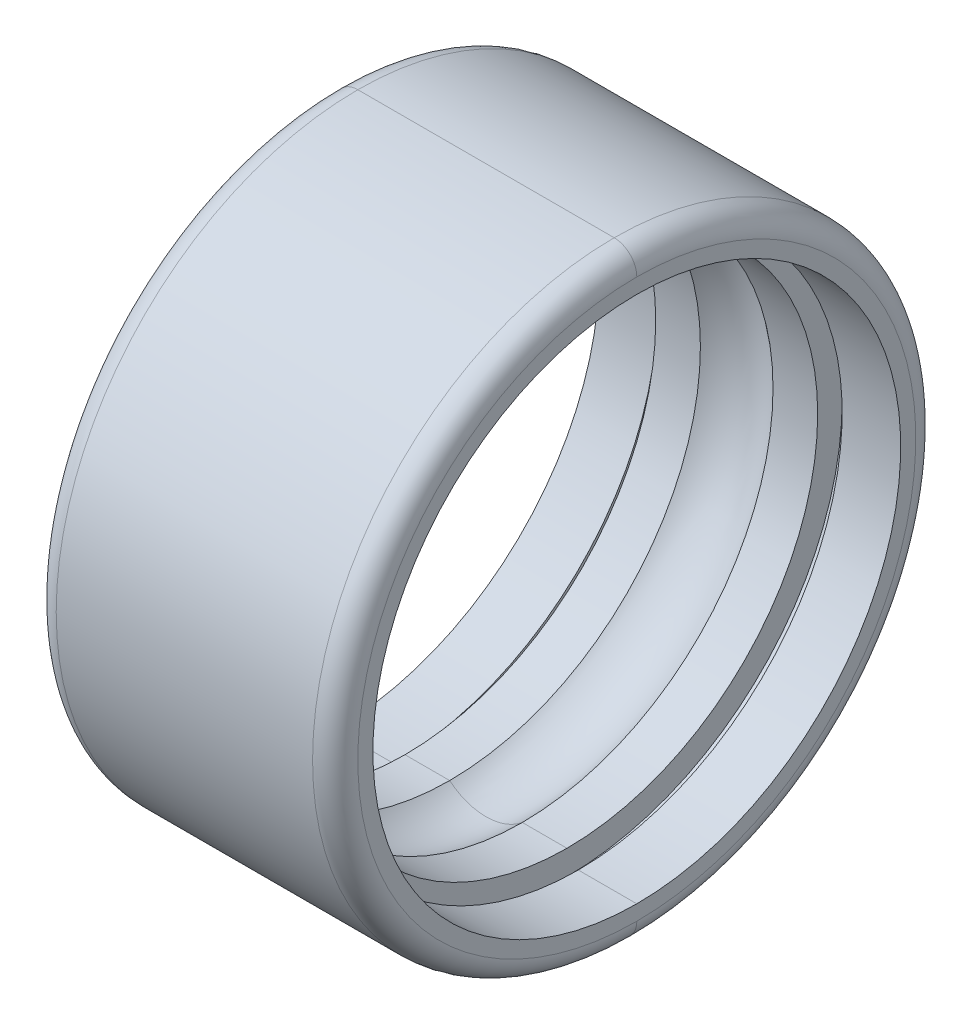
ISO-10303-21;
HEADER;
FILE_DESCRIPTION(('STEP AP214'),'2;1');
FILE_NAME('part.step','',(''),(''),'','','');
FILE_SCHEMA(('AUTOMOTIVE_DESIGN { 1 0 10303 214 1 1 1 1 }'));
ENDSEC;
DATA;
#1=APPLICATION_CONTEXT('core data for automotive mechanical design processes');
#2=APPLICATION_PROTOCOL_DEFINITION('international standard','automotive_design',2000,#1);
#3=PRODUCT_CONTEXT('',#1,'mechanical');
#4=PRODUCT('Part','Part','',(#3));
#5=PRODUCT_RELATED_PRODUCT_CATEGORY('part','',(#4));
#6=PRODUCT_DEFINITION_FORMATION('','',#4);
#7=PRODUCT_DEFINITION_CONTEXT('part definition',#1,'design');
#8=PRODUCT_DEFINITION('design','',#6,#7);
#9=PRODUCT_DEFINITION_SHAPE('','',#8);
#10=(LENGTH_UNIT() NAMED_UNIT(*) SI_UNIT(.MILLI.,.METRE.));
#11=(NAMED_UNIT(*) PLANE_ANGLE_UNIT() SI_UNIT($,.RADIAN.));
#12=(NAMED_UNIT(*) SI_UNIT($,.STERADIAN.) SOLID_ANGLE_UNIT());
#13=UNCERTAINTY_MEASURE_WITH_UNIT(LENGTH_MEASURE(1.E-05),#10,'distance_accuracy_value','');
#14=(GEOMETRIC_REPRESENTATION_CONTEXT(3) GLOBAL_UNCERTAINTY_ASSIGNED_CONTEXT((#13)) GLOBAL_UNIT_ASSIGNED_CONTEXT((#10,
#11,#12)) REPRESENTATION_CONTEXT('',''));
#15=CARTESIAN_POINT('',(0.,0.,0.));
#16=DIRECTION('',(0.,0.,1.));
#17=DIRECTION('',(1.,0.,0.));
#18=AXIS2_PLACEMENT_3D('',#15,#16,#17);
#19=CARTESIAN_POINT('',(2.,0.,0.));
#20=DIRECTION('',(1.,0.,0.));
#21=DIRECTION('',(0.,1.,0.));
#22=AXIS2_PLACEMENT_3D('',#19,#20,#21);
#23=PLANE('',#22);
#24=CARTESIAN_POINT('',(2.,0.,0.));
#25=DIRECTION('',(-1.,0.,0.));
#26=DIRECTION('',(0.,1.,0.));
#27=AXIS2_PLACEMENT_3D('',#24,#25,#26);
#28=CIRCLE('',#27,3.5);
#29=CARTESIAN_POINT('',(2.,3.5,0.));
#30=VERTEX_POINT('',#29);
#31=CARTESIAN_POINT('',(2.,-3.5,0.));
#32=VERTEX_POINT('',#31);
#33=EDGE_CURVE('E207',#30,#32,#28,.T.);
#34=ORIENTED_EDGE('',*,*,#33,.T.);
#35=CARTESIAN_POINT('',(2.,0.,0.));
#36=DIRECTION('',(-1.,0.,0.));
#37=DIRECTION('',(0.,1.,0.));
#38=AXIS2_PLACEMENT_3D('',#35,#36,#37);
#39=CIRCLE('',#38,3.5);
#40=EDGE_CURVE('E11',#32,#30,#39,.T.);
#41=ORIENTED_EDGE('',*,*,#40,.T.);
#42=EDGE_LOOP('',(#34,#41));
#43=FACE_BOUND('',#42,.T.);
#44=CARTESIAN_POINT('',(2.,0.,0.));
#45=DIRECTION('',(1.,0.,0.));
#46=DIRECTION('',(0.,1.,0.));
#47=AXIS2_PLACEMENT_3D('',#44,#45,#46);
#48=CIRCLE('',#47,3.7);
#49=CARTESIAN_POINT('',(2.,3.7,0.));
#50=VERTEX_POINT('',#49);
#51=CARTESIAN_POINT('',(2.,-3.7,0.));
#52=VERTEX_POINT('',#51);
#53=EDGE_CURVE('E190',#50,#52,#48,.T.);
#54=ORIENTED_EDGE('',*,*,#53,.T.);
#55=CARTESIAN_POINT('',(2.,0.,0.));
#56=DIRECTION('',(1.,0.,0.));
#57=DIRECTION('',(0.,1.,0.));
#58=AXIS2_PLACEMENT_3D('',#55,#56,#57);
#59=CIRCLE('',#58,3.7);
#60=EDGE_CURVE('E255',#52,#50,#59,.T.);
#61=ORIENTED_EDGE('',*,*,#60,.T.);
#62=EDGE_LOOP('',(#54,#61));
#63=FACE_BOUND('',#62,.T.);
#64=ADVANCED_FACE('F17',(#43,#63),#23,.T.);
#65=CARTESIAN_POINT('',(2.,0.,0.));
#66=DIRECTION('',(1.,0.,0.));
#67=DIRECTION('',(0.,1.,0.));
#68=AXIS2_PLACEMENT_3D('',#65,#66,#67);
#69=CYLINDRICAL_SURFACE('',#68,3.325);
#70=DIRECTION('',(1.,0.,0.));
#71=VECTOR('',#70,1.);
#72=CARTESIAN_POINT('',(2.,-3.325,0.));
#73=LINE('',#72,#71);
#74=CARTESIAN_POINT('',(0.48153400710646,-3.325,0.));
#75=VERTEX_POINT('',#74);
#76=CARTESIAN_POINT('',(1.0740740740741,-3.325,0.));
#77=VERTEX_POINT('',#76);
#78=EDGE_CURVE('E297',#75,#77,#73,.T.);
#79=ORIENTED_EDGE('',*,*,#78,.F.);
#80=CARTESIAN_POINT('',(0.48153400710646,0.,0.));
#81=DIRECTION('',(-1.,0.,0.));
#82=DIRECTION('',(0.,-1.,0.));
#83=AXIS2_PLACEMENT_3D('',#80,#81,#82);
#84=CIRCLE('',#83,3.325);
#85=CARTESIAN_POINT('',(0.48153400710646,3.325,0.));
#86=VERTEX_POINT('',#85);
#87=EDGE_CURVE('E248',#75,#86,#84,.T.);
#88=ORIENTED_EDGE('',*,*,#87,.T.);
#89=DIRECTION('',(1.,0.,0.));
#90=VECTOR('',#89,1.);
#91=CARTESIAN_POINT('',(2.,3.325,0.));
#92=LINE('',#91,#90);
#93=CARTESIAN_POINT('',(1.0740740740741,3.325,0.));
#94=VERTEX_POINT('',#93);
#95=EDGE_CURVE('E196',#86,#94,#92,.T.);
#96=ORIENTED_EDGE('',*,*,#95,.T.);
#97=CARTESIAN_POINT('',(1.0740740740741,0.,0.));
#98=DIRECTION('',(1.,0.,0.));
#99=DIRECTION('',(0.,1.,0.));
#100=AXIS2_PLACEMENT_3D('',#97,#98,#99);
#101=CIRCLE('',#100,3.325);
#102=EDGE_CURVE('E28',#94,#77,#101,.T.);
#103=ORIENTED_EDGE('',*,*,#102,.T.);
#104=EDGE_LOOP('',(#79,#88,#96,#103));
#105=FACE_BOUND('',#104,.T.);
#106=ADVANCED_FACE('F369',(#105),#69,.F.);
#107=CARTESIAN_POINT('',(1.2240740740741,0.,0.));
#108=DIRECTION('',(1.,0.,0.));
#109=DIRECTION('',(0.,1.,0.));
#110=AXIS2_PLACEMENT_3D('',#107,#108,#109);
#111=CYLINDRICAL_SURFACE('',#110,3.5);
#112=DIRECTION('',(1.,0.,0.));
#113=VECTOR('',#112,1.);
#114=CARTESIAN_POINT('',(1.2240740740741,-3.5,0.));
#115=LINE('',#114,#113);
#116=CARTESIAN_POINT('',(1.2240740740741,-3.5,0.));
#117=VERTEX_POINT('',#116);
#118=EDGE_CURVE('E195',#117,#32,#115,.T.);
#119=ORIENTED_EDGE('',*,*,#118,.F.);
#120=CARTESIAN_POINT('',(1.2240740740741,0.,0.));
#121=DIRECTION('',(1.,0.,0.));
#122=DIRECTION('',(0.,1.,0.));
#123=AXIS2_PLACEMENT_3D('',#120,#121,#122);
#124=CIRCLE('',#123,3.5);
#125=CARTESIAN_POINT('',(1.2240740740741,3.5,0.));
#126=VERTEX_POINT('',#125);
#127=EDGE_CURVE('E245',#126,#117,#124,.T.);
#128=ORIENTED_EDGE('',*,*,#127,.F.);
#129=DIRECTION('',(1.,0.,0.));
#130=VECTOR('',#129,1.);
#131=CARTESIAN_POINT('',(1.2240740740741,3.5,0.));
#132=LINE('',#131,#130);
#133=EDGE_CURVE('E203',#126,#30,#132,.T.);
#134=ORIENTED_EDGE('',*,*,#133,.T.);
#135=ORIENTED_EDGE('',*,*,#40,.F.);
#136=EDGE_LOOP('',(#119,#128,#134,#135));
#137=FACE_BOUND('',#136,.T.);
#138=ADVANCED_FACE('F610',(#137),#111,.F.);
#139=CARTESIAN_POINT('',(1.0740740740741,0.,0.));
#140=DIRECTION('',(-1.,0.,0.));
#141=DIRECTION('',(0.,0.,1.));
#142=AXIS2_PLACEMENT_3D('',#139,#140,#141);
#143=PLANE('',#142);
#144=ORIENTED_EDGE('',*,*,#102,.F.);
#145=CARTESIAN_POINT('',(1.0740740740741,0.,0.));
#146=DIRECTION('',(1.,0.,0.));
#147=DIRECTION('',(0.,1.,0.));
#148=AXIS2_PLACEMENT_3D('',#145,#146,#147);
#149=CIRCLE('',#148,3.325);
#150=EDGE_CURVE('E219',#77,#94,#149,.T.);
#151=ORIENTED_EDGE('',*,*,#150,.F.);
#152=EDGE_LOOP('',(#144,#151));
#153=FACE_BOUND('',#152,.T.);
#154=CARTESIAN_POINT('',(1.0740740740741,0.,0.));
#155=DIRECTION('',(1.,0.,0.));
#156=DIRECTION('',(0.,1.,0.));
#157=AXIS2_PLACEMENT_3D('',#154,#155,#156);
#158=CIRCLE('',#157,3.65);
#159=CARTESIAN_POINT('',(1.0740740740741,3.65,0.));
#160=VERTEX_POINT('',#159);
#161=CARTESIAN_POINT('',(1.0740740740741,-3.65,0.));
#162=VERTEX_POINT('',#161);
#163=EDGE_CURVE('E209',#160,#162,#158,.T.);
#164=ORIENTED_EDGE('',*,*,#163,.T.);
#165=CARTESIAN_POINT('',(1.0740740740741,0.,0.));
#166=DIRECTION('',(1.,0.,0.));
#167=DIRECTION('',(0.,1.,0.));
#168=AXIS2_PLACEMENT_3D('',#165,#166,#167);
#169=CIRCLE('',#168,3.65);
#170=EDGE_CURVE('E317',#162,#160,#169,.T.);
#171=ORIENTED_EDGE('',*,*,#170,.T.);
#172=EDGE_LOOP('',(#164,#171));
#173=FACE_BOUND('',#172,.T.);
#174=ADVANCED_FACE('F689',(#153,#173),#143,.F.);
#175=CARTESIAN_POINT('',(1.7,0.,0.));
#176=DIRECTION('',(1.,0.,0.));
#177=DIRECTION('',(0.,1.,0.));
#178=AXIS2_PLACEMENT_3D('',#175,#176,#177);
#179=TOROIDAL_SURFACE('',#178,3.7,0.3);
#180=CARTESIAN_POINT('',(1.7,-3.7,0.));
#181=DIRECTION('',(0.,0.,1.));
#182=DIRECTION('',(0.,-1.,0.));
#183=AXIS2_PLACEMENT_3D('',#180,#181,#182);
#184=CIRCLE('',#183,0.3);
#185=CARTESIAN_POINT('',(1.7,-4.,0.));
#186=VERTEX_POINT('',#185);
#187=EDGE_CURVE('E234',#186,#52,#184,.T.);
#188=ORIENTED_EDGE('',*,*,#187,.F.);
#189=CARTESIAN_POINT('',(1.7,0.,0.));
#190=DIRECTION('',(1.,0.,0.));
#191=DIRECTION('',(0.,1.,0.));
#192=AXIS2_PLACEMENT_3D('',#189,#190,#191);
#193=CIRCLE('',#192,4.);
#194=CARTESIAN_POINT('',(1.7,4.,0.));
#195=VERTEX_POINT('',#194);
#196=EDGE_CURVE('E183',#186,#195,#193,.T.);
#197=ORIENTED_EDGE('',*,*,#196,.T.);
#198=CARTESIAN_POINT('',(1.7,3.7,0.));
#199=DIRECTION('',(0.,0.,-1.));
#200=DIRECTION('',(-1.,0.,0.));
#201=AXIS2_PLACEMENT_3D('',#198,#199,#200);
#202=CIRCLE('',#201,0.3);
#203=EDGE_CURVE('E185',#195,#50,#202,.T.);
#204=ORIENTED_EDGE('',*,*,#203,.T.);
#205=ORIENTED_EDGE('',*,*,#60,.F.);
#206=EDGE_LOOP('',(#188,#197,#204,#205));
#207=FACE_BOUND('',#206,.T.);
#208=ADVANCED_FACE('F700',(#207),#179,.T.);
#209=CARTESIAN_POINT('',(0.,0.,0.));
#210=DIRECTION('',(1.,0.,0.));
#211=DIRECTION('',(0.,1.,0.));
#212=AXIS2_PLACEMENT_3D('',#209,#210,#211);
#213=TOROIDAL_SURFACE('',#212,2.75,0.75);
#214=CARTESIAN_POINT('',(0.,-2.75,0.));
#215=DIRECTION('',(0.,0.,1.));
#216=DIRECTION('',(0.,-1.,0.));
#217=AXIS2_PLACEMENT_3D('',#214,#215,#216);
#218=CIRCLE('',#217,0.75);
#219=CARTESIAN_POINT('',(-0.48153400710646,-3.325,0.));
#220=VERTEX_POINT('',#219);
#221=EDGE_CURVE('E287',#220,#75,#218,.T.);
#222=ORIENTED_EDGE('',*,*,#221,.F.);
#223=CARTESIAN_POINT('',(-0.48153400710646,0.,0.));
#224=DIRECTION('',(1.,0.,0.));
#225=DIRECTION('',(0.,-1.,0.));
#226=AXIS2_PLACEMENT_3D('',#223,#224,#225);
#227=CIRCLE('',#226,3.325);
#228=CARTESIAN_POINT('',(-0.48153400710646,3.325,0.));
#229=VERTEX_POINT('',#228);
#230=EDGE_CURVE('E179',#229,#220,#227,.T.);
#231=ORIENTED_EDGE('',*,*,#230,.F.);
#232=CARTESIAN_POINT('',(0.,2.75,0.));
#233=DIRECTION('',(0.,0.,-1.));
#234=DIRECTION('',(-1.,0.,0.));
#235=AXIS2_PLACEMENT_3D('',#232,#233,#234);
#236=CIRCLE('',#235,0.75);
#237=EDGE_CURVE('E177',#229,#86,#236,.T.);
#238=ORIENTED_EDGE('',*,*,#237,.T.);
#239=ORIENTED_EDGE('',*,*,#87,.F.);
#240=EDGE_LOOP('',(#222,#231,#238,#239));
#241=FACE_BOUND('',#240,.T.);
#242=ADVANCED_FACE('F355',(#241),#213,.F.);
#243=CARTESIAN_POINT('',(1.2240740740741,0.,0.));
#244=DIRECTION('',(1.,0.,0.));
#245=DIRECTION('',(0.,1.,0.));
#246=AXIS2_PLACEMENT_3D('',#243,#244,#245);
#247=PLANE('',#246);
#248=ORIENTED_EDGE('',*,*,#127,.T.);
#249=CARTESIAN_POINT('',(1.2240740740741,0.,0.));
#250=DIRECTION('',(1.,0.,0.));
#251=DIRECTION('',(0.,1.,0.));
#252=AXIS2_PLACEMENT_3D('',#249,#250,#251);
#253=CIRCLE('',#252,3.5);
#254=EDGE_CURVE('E191',#117,#126,#253,.T.);
#255=ORIENTED_EDGE('',*,*,#254,.T.);
#256=EDGE_LOOP('',(#248,#255));
#257=FACE_BOUND('',#256,.T.);
#258=CARTESIAN_POINT('',(1.2240740740741,0.,0.));
#259=DIRECTION('',(1.,0.,0.));
#260=DIRECTION('',(0.,1.,0.));
#261=AXIS2_PLACEMENT_3D('',#258,#259,#260);
#262=CIRCLE('',#261,3.65);
#263=CARTESIAN_POINT('',(1.2240740740741,3.65,0.));
#264=VERTEX_POINT('',#263);
#265=CARTESIAN_POINT('',(1.2240740740741,-3.65,0.));
#266=VERTEX_POINT('',#265);
#267=EDGE_CURVE('E212',#264,#266,#262,.T.);
#268=ORIENTED_EDGE('',*,*,#267,.F.);
#269=CARTESIAN_POINT('',(1.2240740740741,0.,0.));
#270=DIRECTION('',(1.,0.,0.));
#271=DIRECTION('',(0.,1.,0.));
#272=AXIS2_PLACEMENT_3D('',#269,#270,#271);
#273=CIRCLE('',#272,3.65);
#274=EDGE_CURVE('E225',#266,#264,#273,.T.);
#275=ORIENTED_EDGE('',*,*,#274,.F.);
#276=EDGE_LOOP('',(#268,#275));
#277=FACE_BOUND('',#276,.T.);
#278=ADVANCED_FACE('F594',(#257,#277),#247,.F.);
#279=CARTESIAN_POINT('',(1.0740740740741,0.,0.));
#280=DIRECTION('',(1.,0.,0.));
#281=DIRECTION('',(0.,1.,0.));
#282=AXIS2_PLACEMENT_3D('',#279,#280,#281);
#283=CYLINDRICAL_SURFACE('',#282,3.65);
#284=DIRECTION('',(1.,0.,0.));
#285=VECTOR('',#284,1.);
#286=CARTESIAN_POINT('',(1.0740740740741,-3.65,0.));
#287=LINE('',#286,#285);
#288=EDGE_CURVE('E230',#162,#266,#287,.T.);
#289=ORIENTED_EDGE('',*,*,#288,.F.);
#290=ORIENTED_EDGE('',*,*,#163,.F.);
#291=DIRECTION('',(1.,0.,0.));
#292=VECTOR('',#291,1.);
#293=CARTESIAN_POINT('',(1.0740740740741,3.65,0.));
#294=LINE('',#293,#292);
#295=EDGE_CURVE('E229',#160,#264,#294,.T.);
#296=ORIENTED_EDGE('',*,*,#295,.T.);
#297=ORIENTED_EDGE('',*,*,#267,.T.);
#298=EDGE_LOOP('',(#289,#290,#296,#297));
#299=FACE_BOUND('',#298,.T.);
#300=ADVANCED_FACE('F599',(#299),#283,.F.);
#301=CARTESIAN_POINT('',(-1.99999999999997,0.,0.));
#302=DIRECTION('',(1.,0.,0.));
#303=DIRECTION('',(0.,1.,0.));
#304=AXIS2_PLACEMENT_3D('',#301,#302,#303);
#305=CYLINDRICAL_SURFACE('',#304,4.);
#306=DIRECTION('',(1.,0.,0.));
#307=VECTOR('',#306,1.);
#308=CARTESIAN_POINT('',(-1.99999999999997,-4.,0.));
#309=LINE('',#308,#307);
#310=CARTESIAN_POINT('',(-1.69999999999997,-4.,0.));
#311=VERTEX_POINT('',#310);
#312=EDGE_CURVE('E224',#311,#186,#309,.T.);
#313=ORIENTED_EDGE('',*,*,#312,.F.);
#314=CARTESIAN_POINT('',(-1.69999999999997,0.,0.));
#315=DIRECTION('',(1.,0.,0.));
#316=DIRECTION('',(0.,1.,0.));
#317=AXIS2_PLACEMENT_3D('',#314,#315,#316);
#318=CIRCLE('',#317,4.);
#319=CARTESIAN_POINT('',(-1.69999999999997,4.,0.));
#320=VERTEX_POINT('',#319);
#321=EDGE_CURVE('E184',#311,#320,#318,.T.);
#322=ORIENTED_EDGE('',*,*,#321,.T.);
#323=DIRECTION('',(1.,0.,0.));
#324=VECTOR('',#323,1.);
#325=CARTESIAN_POINT('',(-1.99999999999997,4.,0.));
#326=LINE('',#325,#324);
#327=EDGE_CURVE('E220',#320,#195,#326,.T.);
#328=ORIENTED_EDGE('',*,*,#327,.T.);
#329=ORIENTED_EDGE('',*,*,#196,.F.);
#330=EDGE_LOOP('',(#313,#322,#328,#329));
#331=FACE_BOUND('',#330,.T.);
#332=ADVANCED_FACE('F649',(#331),#305,.T.);
#333=CARTESIAN_POINT('',(2.,0.,0.));
#334=DIRECTION('',(1.,0.,0.));
#335=DIRECTION('',(0.,1.,0.));
#336=AXIS2_PLACEMENT_3D('',#333,#334,#335);
#337=CYLINDRICAL_SURFACE('',#336,3.325);
#338=DIRECTION('',(1.,0.,0.));
#339=VECTOR('',#338,1.);
#340=CARTESIAN_POINT('',(2.,-3.325,0.));
#341=LINE('',#340,#339);
#342=CARTESIAN_POINT('',(-1.07407407407405,-3.325,0.));
#343=VERTEX_POINT('',#342);
#344=EDGE_CURVE('E202',#343,#220,#341,.T.);
#345=ORIENTED_EDGE('',*,*,#344,.F.);
#346=CARTESIAN_POINT('',(-1.07407407407405,0.,0.));
#347=DIRECTION('',(-1.,0.,0.));
#348=DIRECTION('',(0.,1.,0.));
#349=AXIS2_PLACEMENT_3D('',#346,#347,#348);
#350=CIRCLE('',#349,3.325);
#351=CARTESIAN_POINT('',(-1.07407407407405,3.325,0.));
#352=VERTEX_POINT('',#351);
#353=EDGE_CURVE('E95',#343,#352,#350,.T.);
#354=ORIENTED_EDGE('',*,*,#353,.T.);
#355=DIRECTION('',(1.,0.,0.));
#356=VECTOR('',#355,1.);
#357=CARTESIAN_POINT('',(2.,3.325,0.));
#358=LINE('',#357,#356);
#359=EDGE_CURVE('E197',#352,#229,#358,.T.);
#360=ORIENTED_EDGE('',*,*,#359,.T.);
#361=ORIENTED_EDGE('',*,*,#230,.T.);
#362=EDGE_LOOP('',(#345,#354,#360,#361));
#363=FACE_BOUND('',#362,.T.);
#364=ADVANCED_FACE('F643',(#363),#337,.F.);
#365=CARTESIAN_POINT('',(-1.69999999999997,0.,0.));
#366=DIRECTION('',(1.,0.,0.));
#367=DIRECTION('',(0.,1.,0.));
#368=AXIS2_PLACEMENT_3D('',#365,#366,#367);
#369=TOROIDAL_SURFACE('',#368,3.7,0.3);
#370=CARTESIAN_POINT('',(-1.69999999999997,-3.7,0.));
#371=DIRECTION('',(0.,0.,1.));
#372=DIRECTION('',(0.,-1.,0.));
#373=AXIS2_PLACEMENT_3D('',#370,#371,#372);
#374=CIRCLE('',#373,0.3);
#375=CARTESIAN_POINT('',(-1.99999999999997,-3.7,0.));
#376=VERTEX_POINT('',#375);
#377=EDGE_CURVE('E173',#376,#311,#374,.T.);
#378=ORIENTED_EDGE('',*,*,#377,.F.);
#379=CARTESIAN_POINT('',(-1.99999999999997,0.,0.));
#380=DIRECTION('',(1.,0.,0.));
#381=DIRECTION('',(0.,1.,0.));
#382=AXIS2_PLACEMENT_3D('',#379,#380,#381);
#383=CIRCLE('',#382,3.7);
#384=CARTESIAN_POINT('',(-1.99999999999997,3.7,0.));
#385=VERTEX_POINT('',#384);
#386=EDGE_CURVE('E81',#376,#385,#383,.T.);
#387=ORIENTED_EDGE('',*,*,#386,.T.);
#388=CARTESIAN_POINT('',(-1.69999999999997,3.7,0.));
#389=DIRECTION('',(0.,0.,-1.));
#390=DIRECTION('',(-1.,0.,0.));
#391=AXIS2_PLACEMENT_3D('',#388,#389,#390);
#392=CIRCLE('',#391,0.3);
#393=EDGE_CURVE('E165',#385,#320,#392,.T.);
#394=ORIENTED_EDGE('',*,*,#393,.T.);
#395=ORIENTED_EDGE('',*,*,#321,.F.);
#396=EDGE_LOOP('',(#378,#387,#394,#395));
#397=FACE_BOUND('',#396,.T.);
#398=ADVANCED_FACE('F648',(#397),#369,.T.);
#399=CARTESIAN_POINT('',(-1.07407407407405,0.,0.));
#400=DIRECTION('',(1.,0.,0.));
#401=DIRECTION('',(0.,1.,0.));
#402=AXIS2_PLACEMENT_3D('',#399,#400,#401);
#403=PLANE('',#402);
#404=CARTESIAN_POINT('',(-1.07407407407405,0.,0.));
#405=DIRECTION('',(-1.,0.,0.));
#406=DIRECTION('',(0.,1.,0.));
#407=AXIS2_PLACEMENT_3D('',#404,#405,#406);
#408=CIRCLE('',#407,3.325);
#409=EDGE_CURVE('E21',#352,#343,#408,.T.);
#410=ORIENTED_EDGE('',*,*,#409,.F.);
#411=ORIENTED_EDGE('',*,*,#353,.F.);
#412=EDGE_LOOP('',(#410,#411));
#413=FACE_BOUND('',#412,.T.);
#414=CARTESIAN_POINT('',(-1.07407407407405,0.,0.));
#415=DIRECTION('',(1.,0.,0.));
#416=DIRECTION('',(0.,1.,0.));
#417=AXIS2_PLACEMENT_3D('',#414,#415,#416);
#418=CIRCLE('',#417,3.65);
#419=CARTESIAN_POINT('',(-1.07407407407405,3.65,0.));
#420=VERTEX_POINT('',#419);
#421=CARTESIAN_POINT('',(-1.07407407407405,-3.65,0.));
#422=VERTEX_POINT('',#421);
#423=EDGE_CURVE('E302',#420,#422,#418,.T.);
#424=ORIENTED_EDGE('',*,*,#423,.F.);
#425=CARTESIAN_POINT('',(-1.07407407407405,0.,0.));
#426=DIRECTION('',(1.,0.,0.));
#427=DIRECTION('',(0.,1.,0.));
#428=AXIS2_PLACEMENT_3D('',#425,#426,#427);
#429=CIRCLE('',#428,3.65);
#430=EDGE_CURVE('E159',#422,#420,#429,.T.);
#431=ORIENTED_EDGE('',*,*,#430,.F.);
#432=EDGE_LOOP('',(#424,#431));
#433=FACE_BOUND('',#432,.T.);
#434=ADVANCED_FACE('F661',(#413,#433),#403,.F.);
#435=CARTESIAN_POINT('',(-1.99999999999997,0.,0.));
#436=DIRECTION('',(-1.,0.,0.));
#437=DIRECTION('',(0.,0.,1.));
#438=AXIS2_PLACEMENT_3D('',#435,#436,#437);
#439=PLANE('',#438);
#440=CARTESIAN_POINT('',(-1.99999999999997,0.,0.));
#441=DIRECTION('',(1.,0.,0.));
#442=DIRECTION('',(0.,1.,0.));
#443=AXIS2_PLACEMENT_3D('',#440,#441,#442);
#444=CIRCLE('',#443,3.5);
#445=CARTESIAN_POINT('',(-1.99999999999997,3.5,0.));
#446=VERTEX_POINT('',#445);
#447=CARTESIAN_POINT('',(-1.99999999999997,-3.5,0.));
#448=VERTEX_POINT('',#447);
#449=EDGE_CURVE('E298',#446,#448,#444,.T.);
#450=ORIENTED_EDGE('',*,*,#449,.T.);
#451=CARTESIAN_POINT('',(-1.99999999999997,0.,0.));
#452=DIRECTION('',(1.,0.,0.));
#453=DIRECTION('',(0.,1.,0.));
#454=AXIS2_PLACEMENT_3D('',#451,#452,#453);
#455=CIRCLE('',#454,3.5);
#456=EDGE_CURVE('E161',#448,#446,#455,.T.);
#457=ORIENTED_EDGE('',*,*,#456,.T.);
#458=EDGE_LOOP('',(#450,#457));
#459=FACE_BOUND('',#458,.T.);
#460=CARTESIAN_POINT('',(-1.99999999999997,0.,0.));
#461=DIRECTION('',(1.,0.,0.));
#462=DIRECTION('',(0.,1.,0.));
#463=AXIS2_PLACEMENT_3D('',#460,#461,#462);
#464=CIRCLE('',#463,3.7);
#465=EDGE_CURVE('E201',#385,#376,#464,.T.);
#466=ORIENTED_EDGE('',*,*,#465,.F.);
#467=ORIENTED_EDGE('',*,*,#386,.F.);
#468=EDGE_LOOP('',(#466,#467));
#469=FACE_BOUND('',#468,.T.);
#470=ADVANCED_FACE('F622',(#459,#469),#439,.T.);
#471=CARTESIAN_POINT('',(-1.22407407407405,0.,0.));
#472=DIRECTION('',(1.,0.,0.));
#473=DIRECTION('',(0.,1.,0.));
#474=AXIS2_PLACEMENT_3D('',#471,#472,#473);
#475=CYLINDRICAL_SURFACE('',#474,3.65);
#476=DIRECTION('',(1.,0.,0.));
#477=VECTOR('',#476,1.);
#478=CARTESIAN_POINT('',(-1.22407407407405,-3.65,0.));
#479=LINE('',#478,#477);
#480=CARTESIAN_POINT('',(-1.22407407407405,-3.65,0.));
#481=VERTEX_POINT('',#480);
#482=EDGE_CURVE('E150',#481,#422,#479,.T.);
#483=ORIENTED_EDGE('',*,*,#482,.F.);
#484=CARTESIAN_POINT('',(-1.22407407407405,0.,0.));
#485=DIRECTION('',(1.,0.,0.));
#486=DIRECTION('',(0.,1.,0.));
#487=AXIS2_PLACEMENT_3D('',#484,#485,#486);
#488=CIRCLE('',#487,3.65);
#489=CARTESIAN_POINT('',(-1.22407407407405,3.65,0.));
#490=VERTEX_POINT('',#489);
#491=EDGE_CURVE('E138',#490,#481,#488,.T.);
#492=ORIENTED_EDGE('',*,*,#491,.F.);
#493=DIRECTION('',(1.,0.,0.));
#494=VECTOR('',#493,1.);
#495=CARTESIAN_POINT('',(-1.22407407407405,3.65,0.));
#496=LINE('',#495,#494);
#497=EDGE_CURVE('E147',#490,#420,#496,.T.);
#498=ORIENTED_EDGE('',*,*,#497,.T.);
#499=ORIENTED_EDGE('',*,*,#423,.T.);
#500=EDGE_LOOP('',(#483,#492,#498,#499));
#501=FACE_BOUND('',#500,.T.);
#502=ADVANCED_FACE('F146',(#501),#475,.F.);
#503=CARTESIAN_POINT('',(-1.99999999999997,0.,0.));
#504=DIRECTION('',(1.,0.,0.));
#505=DIRECTION('',(0.,1.,0.));
#506=AXIS2_PLACEMENT_3D('',#503,#504,#505);
#507=CYLINDRICAL_SURFACE('',#506,3.5);
#508=DIRECTION('',(1.,0.,0.));
#509=VECTOR('',#508,1.);
#510=CARTESIAN_POINT('',(-1.99999999999997,-3.5,0.));
#511=LINE('',#510,#509);
#512=CARTESIAN_POINT('',(-1.22407407407405,-3.5,0.));
#513=VERTEX_POINT('',#512);
#514=EDGE_CURVE('E241',#448,#513,#511,.T.);
#515=ORIENTED_EDGE('',*,*,#514,.F.);
#516=ORIENTED_EDGE('',*,*,#449,.F.);
#517=DIRECTION('',(1.,0.,0.));
#518=VECTOR('',#517,1.);
#519=CARTESIAN_POINT('',(-1.99999999999997,3.5,0.));
#520=LINE('',#519,#518);
#521=CARTESIAN_POINT('',(-1.22407407407405,3.5,0.));
#522=VERTEX_POINT('',#521);
#523=EDGE_CURVE('E153',#446,#522,#520,.T.);
#524=ORIENTED_EDGE('',*,*,#523,.T.);
#525=CARTESIAN_POINT('',(-1.22407407407405,0.,0.));
#526=DIRECTION('',(1.,0.,0.));
#527=DIRECTION('',(0.,1.,0.));
#528=AXIS2_PLACEMENT_3D('',#525,#526,#527);
#529=CIRCLE('',#528,3.5);
#530=EDGE_CURVE('E42',#522,#513,#529,.T.);
#531=ORIENTED_EDGE('',*,*,#530,.T.);
#532=EDGE_LOOP('',(#515,#516,#524,#531));
#533=FACE_BOUND('',#532,.T.);
#534=ADVANCED_FACE('F621',(#533),#507,.F.);
#535=CARTESIAN_POINT('',(-1.22407407407405,0.,0.));
#536=DIRECTION('',(-1.,0.,0.));
#537=DIRECTION('',(0.,0.,1.));
#538=AXIS2_PLACEMENT_3D('',#535,#536,#537);
#539=PLANE('',#538);
#540=ORIENTED_EDGE('',*,*,#530,.F.);
#541=CARTESIAN_POINT('',(-1.22407407407405,0.,0.));
#542=DIRECTION('',(1.,0.,0.));
#543=DIRECTION('',(0.,1.,0.));
#544=AXIS2_PLACEMENT_3D('',#541,#542,#543);
#545=CIRCLE('',#544,3.5);
#546=EDGE_CURVE('E244',#513,#522,#545,.T.);
#547=ORIENTED_EDGE('',*,*,#546,.F.);
#548=EDGE_LOOP('',(#540,#547));
#549=FACE_BOUND('',#548,.T.);
#550=ORIENTED_EDGE('',*,*,#491,.T.);
#551=CARTESIAN_POINT('',(-1.22407407407405,0.,0.));
#552=DIRECTION('',(1.,0.,0.));
#553=DIRECTION('',(0.,1.,0.));
#554=AXIS2_PLACEMENT_3D('',#551,#552,#553);
#555=CIRCLE('',#554,3.65);
#556=EDGE_CURVE('E157',#481,#490,#555,.T.);
#557=ORIENTED_EDGE('',*,*,#556,.T.);
#558=EDGE_LOOP('',(#550,#557));
#559=FACE_BOUND('',#558,.T.);
#560=ADVANCED_FACE('F163',(#549,#559),#539,.F.);
#561=CARTESIAN_POINT('',(-1.99999999999997,0.,0.));
#562=DIRECTION('',(1.,0.,0.));
#563=DIRECTION('',(0.,1.,0.));
#564=AXIS2_PLACEMENT_3D('',#561,#562,#563);
#565=CYLINDRICAL_SURFACE('',#564,3.5);
#566=ORIENTED_EDGE('',*,*,#456,.F.);
#567=ORIENTED_EDGE('',*,*,#514,.T.);
#568=ORIENTED_EDGE('',*,*,#546,.T.);
#569=ORIENTED_EDGE('',*,*,#523,.F.);
#570=EDGE_LOOP('',(#566,#567,#568,#569));
#571=FACE_BOUND('',#570,.T.);
#572=ADVANCED_FACE('F545',(#571),#565,.F.);
#573=CARTESIAN_POINT('',(-1.22407407407405,0.,0.));
#574=DIRECTION('',(1.,0.,0.));
#575=DIRECTION('',(0.,1.,0.));
#576=AXIS2_PLACEMENT_3D('',#573,#574,#575);
#577=CYLINDRICAL_SURFACE('',#576,3.65);
#578=ORIENTED_EDGE('',*,*,#556,.F.);
#579=ORIENTED_EDGE('',*,*,#482,.T.);
#580=ORIENTED_EDGE('',*,*,#430,.T.);
#581=ORIENTED_EDGE('',*,*,#497,.F.);
#582=EDGE_LOOP('',(#578,#579,#580,#581));
#583=FACE_BOUND('',#582,.T.);
#584=ADVANCED_FACE('F156',(#583),#577,.F.);
#585=CARTESIAN_POINT('',(-1.69999999999997,0.,0.));
#586=DIRECTION('',(1.,0.,0.));
#587=DIRECTION('',(0.,1.,0.));
#588=AXIS2_PLACEMENT_3D('',#585,#586,#587);
#589=TOROIDAL_SURFACE('',#588,3.7,0.3);
#590=ORIENTED_EDGE('',*,*,#465,.T.);
#591=ORIENTED_EDGE('',*,*,#377,.T.);
#592=CARTESIAN_POINT('',(-1.69999999999997,0.,0.));
#593=DIRECTION('',(1.,0.,0.));
#594=DIRECTION('',(0.,1.,0.));
#595=AXIS2_PLACEMENT_3D('',#592,#593,#594);
#596=CIRCLE('',#595,4.);
#597=EDGE_CURVE('E320',#320,#311,#596,.T.);
#598=ORIENTED_EDGE('',*,*,#597,.F.);
#599=ORIENTED_EDGE('',*,*,#393,.F.);
#600=EDGE_LOOP('',(#590,#591,#598,#599));
#601=FACE_BOUND('',#600,.T.);
#602=ADVANCED_FACE('F569',(#601),#589,.T.);
#603=CARTESIAN_POINT('',(2.,0.,0.));
#604=DIRECTION('',(1.,0.,0.));
#605=DIRECTION('',(0.,1.,0.));
#606=AXIS2_PLACEMENT_3D('',#603,#604,#605);
#607=CYLINDRICAL_SURFACE('',#606,3.325);
#608=ORIENTED_EDGE('',*,*,#409,.T.);
#609=ORIENTED_EDGE('',*,*,#344,.T.);
#610=CARTESIAN_POINT('',(-0.48153400710646,0.,0.));
#611=DIRECTION('',(1.,0.,0.));
#612=DIRECTION('',(0.,-1.,0.));
#613=AXIS2_PLACEMENT_3D('',#610,#611,#612);
#614=CIRCLE('',#613,3.325);
#615=EDGE_CURVE('E189',#220,#229,#614,.T.);
#616=ORIENTED_EDGE('',*,*,#615,.T.);
#617=ORIENTED_EDGE('',*,*,#359,.F.);
#618=EDGE_LOOP('',(#608,#609,#616,#617));
#619=FACE_BOUND('',#618,.T.);
#620=ADVANCED_FACE('F19',(#619),#607,.F.);
#621=CARTESIAN_POINT('',(-1.99999999999997,0.,0.));
#622=DIRECTION('',(1.,0.,0.));
#623=DIRECTION('',(0.,1.,0.));
#624=AXIS2_PLACEMENT_3D('',#621,#622,#623);
#625=CYLINDRICAL_SURFACE('',#624,4.);
#626=ORIENTED_EDGE('',*,*,#597,.T.);
#627=ORIENTED_EDGE('',*,*,#312,.T.);
#628=CARTESIAN_POINT('',(1.7,0.,0.));
#629=DIRECTION('',(1.,0.,0.));
#630=DIRECTION('',(0.,1.,0.));
#631=AXIS2_PLACEMENT_3D('',#628,#629,#630);
#632=CIRCLE('',#631,4.);
#633=EDGE_CURVE('E206',#195,#186,#632,.T.);
#634=ORIENTED_EDGE('',*,*,#633,.F.);
#635=ORIENTED_EDGE('',*,*,#327,.F.);
#636=EDGE_LOOP('',(#626,#627,#634,#635));
#637=FACE_BOUND('',#636,.T.);
#638=ADVANCED_FACE('F635',(#637),#625,.T.);
#639=CARTESIAN_POINT('',(1.0740740740741,0.,0.));
#640=DIRECTION('',(1.,0.,0.));
#641=DIRECTION('',(0.,1.,0.));
#642=AXIS2_PLACEMENT_3D('',#639,#640,#641);
#643=CYLINDRICAL_SURFACE('',#642,3.65);
#644=ORIENTED_EDGE('',*,*,#170,.F.);
#645=ORIENTED_EDGE('',*,*,#288,.T.);
#646=ORIENTED_EDGE('',*,*,#274,.T.);
#647=ORIENTED_EDGE('',*,*,#295,.F.);
#648=EDGE_LOOP('',(#644,#645,#646,#647));
#649=FACE_BOUND('',#648,.T.);
#650=ADVANCED_FACE('F630',(#649),#643,.F.);
#651=CARTESIAN_POINT('',(0.,0.,0.));
#652=DIRECTION('',(1.,0.,0.));
#653=DIRECTION('',(0.,1.,0.));
#654=AXIS2_PLACEMENT_3D('',#651,#652,#653);
#655=TOROIDAL_SURFACE('',#654,2.75,0.75);
#656=ORIENTED_EDGE('',*,*,#615,.F.);
#657=ORIENTED_EDGE('',*,*,#221,.T.);
#658=CARTESIAN_POINT('',(0.48153400710646,0.,0.));
#659=DIRECTION('',(-1.,0.,0.));
#660=DIRECTION('',(0.,-1.,0.));
#661=AXIS2_PLACEMENT_3D('',#658,#659,#660);
#662=CIRCLE('',#661,3.325);
#663=EDGE_CURVE('E293',#86,#75,#662,.T.);
#664=ORIENTED_EDGE('',*,*,#663,.F.);
#665=ORIENTED_EDGE('',*,*,#237,.F.);
#666=EDGE_LOOP('',(#656,#657,#664,#665));
#667=FACE_BOUND('',#666,.T.);
#668=ADVANCED_FACE('F365',(#667),#655,.F.);
#669=CARTESIAN_POINT('',(1.7,0.,0.));
#670=DIRECTION('',(1.,0.,0.));
#671=DIRECTION('',(0.,1.,0.));
#672=AXIS2_PLACEMENT_3D('',#669,#670,#671);
#673=TOROIDAL_SURFACE('',#672,3.7,0.3);
#674=ORIENTED_EDGE('',*,*,#633,.T.);
#675=ORIENTED_EDGE('',*,*,#187,.T.);
#676=ORIENTED_EDGE('',*,*,#53,.F.);
#677=ORIENTED_EDGE('',*,*,#203,.F.);
#678=EDGE_LOOP('',(#674,#675,#676,#677));
#679=FACE_BOUND('',#678,.T.);
#680=ADVANCED_FACE('F581',(#679),#673,.T.);
#681=CARTESIAN_POINT('',(1.2240740740741,0.,0.));
#682=DIRECTION('',(1.,0.,0.));
#683=DIRECTION('',(0.,1.,0.));
#684=AXIS2_PLACEMENT_3D('',#681,#682,#683);
#685=CYLINDRICAL_SURFACE('',#684,3.5);
#686=ORIENTED_EDGE('',*,*,#254,.F.);
#687=ORIENTED_EDGE('',*,*,#118,.T.);
#688=ORIENTED_EDGE('',*,*,#33,.F.);
#689=ORIENTED_EDGE('',*,*,#133,.F.);
#690=EDGE_LOOP('',(#686,#687,#688,#689));
#691=FACE_BOUND('',#690,.T.);
#692=ADVANCED_FACE('F586',(#691),#685,.F.);
#693=CARTESIAN_POINT('',(2.,0.,0.));
#694=DIRECTION('',(1.,0.,0.));
#695=DIRECTION('',(0.,1.,0.));
#696=AXIS2_PLACEMENT_3D('',#693,#694,#695);
#697=CYLINDRICAL_SURFACE('',#696,3.325);
#698=ORIENTED_EDGE('',*,*,#663,.T.);
#699=ORIENTED_EDGE('',*,*,#78,.T.);
#700=ORIENTED_EDGE('',*,*,#150,.T.);
#701=ORIENTED_EDGE('',*,*,#95,.F.);
#702=EDGE_LOOP('',(#698,#699,#700,#701));
#703=FACE_BOUND('',#702,.T.);
#704=ADVANCED_FACE('F361',(#703),#697,.F.);
#705=CLOSED_SHELL('',(#64,#106,#138,#174,#208,#242,#278,#300,#332,#364,#398,#434,#470,#502,#534,
#560,#572,#584,#602,#620,#638,#650,#668,#680,#692,#704));
#706=MANIFOLD_SOLID_BREP('B1',#705);
#707=ADVANCED_BREP_SHAPE_REPRESENTATION('',(#18,#706),#14);
#708=SHAPE_DEFINITION_REPRESENTATION(#9,#707);
ENDSEC;
END-ISO-10303-21;
